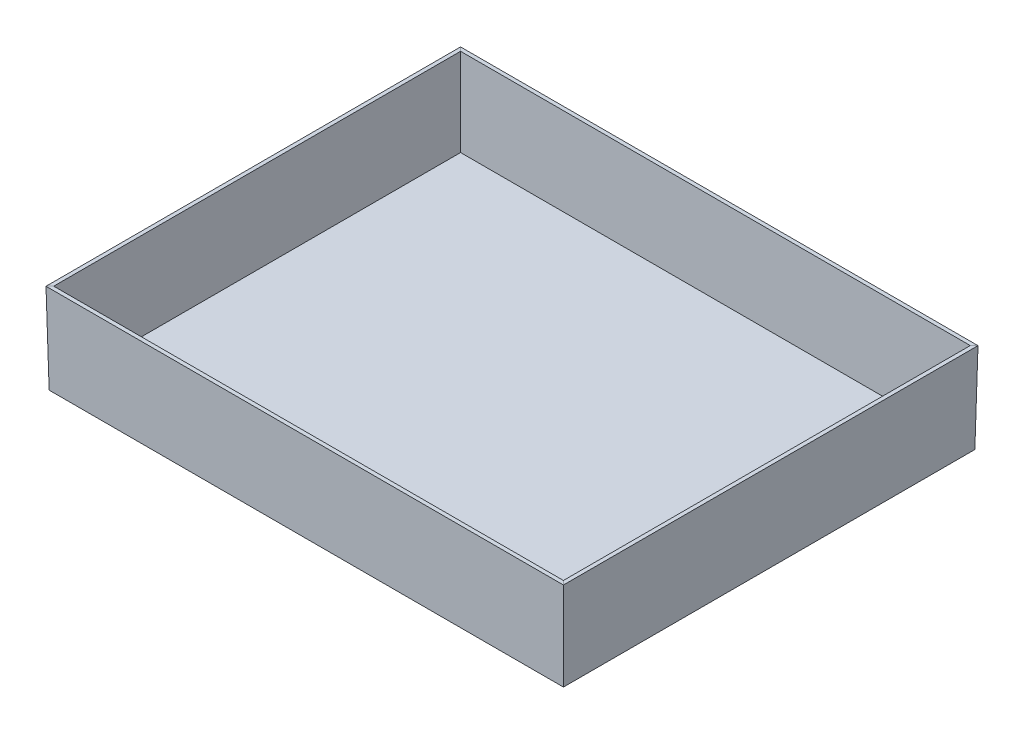
ISO-10303-21;
HEADER;
FILE_DESCRIPTION(('STEP AP214'),'2;1');
FILE_NAME('part.step','',(''),(''),'','','');
FILE_SCHEMA(('AUTOMOTIVE_DESIGN { 1 0 10303 214 1 1 1 1 }'));
ENDSEC;
DATA;
#1=APPLICATION_CONTEXT('core data for automotive mechanical design processes');
#2=APPLICATION_PROTOCOL_DEFINITION('international standard','automotive_design',2000,#1);
#3=PRODUCT_CONTEXT('',#1,'mechanical');
#4=PRODUCT('Part','Part','',(#3));
#5=PRODUCT_RELATED_PRODUCT_CATEGORY('part','',(#4));
#6=PRODUCT_DEFINITION_FORMATION('','',#4);
#7=PRODUCT_DEFINITION_CONTEXT('part definition',#1,'design');
#8=PRODUCT_DEFINITION('design','',#6,#7);
#9=PRODUCT_DEFINITION_SHAPE('','',#8);
#10=(LENGTH_UNIT() NAMED_UNIT(*) SI_UNIT(.MILLI.,.METRE.));
#11=(NAMED_UNIT(*) PLANE_ANGLE_UNIT() SI_UNIT($,.RADIAN.));
#12=(NAMED_UNIT(*) SI_UNIT($,.STERADIAN.) SOLID_ANGLE_UNIT());
#13=UNCERTAINTY_MEASURE_WITH_UNIT(LENGTH_MEASURE(1.E-05),#10,'distance_accuracy_value','');
#14=(GEOMETRIC_REPRESENTATION_CONTEXT(3) GLOBAL_UNCERTAINTY_ASSIGNED_CONTEXT((#13)) GLOBAL_UNIT_ASSIGNED_CONTEXT((#10,
#11,#12)) REPRESENTATION_CONTEXT('',''));
#15=CARTESIAN_POINT('',(0.,0.,0.));
#16=DIRECTION('',(0.,0.,1.));
#17=DIRECTION('',(1.,0.,0.));
#18=AXIS2_PLACEMENT_3D('',#15,#16,#17);
#19=CARTESIAN_POINT('',(-100.610927272488,35.,80.));
#20=DIRECTION('',(0.0174524064372835,-0.999847695156391,0.));
#21=DIRECTION('',(0.,0.,1.));
#22=AXIS2_PLACEMENT_3D('',#19,#20,#21);
#23=PLANE('',#22);
#24=DIRECTION('',(-0.707052927141246,-0.0123416547509364,0.707052927141246));
#25=VECTOR('',#24,1.);
#26=CARTESIAN_POINT('',(-99.111155729753,35.0261786096559,79.111155729753));
#27=LINE('',#26,#25);
#28=CARTESIAN_POINT('',(-99.111155729753,35.0261786096559,79.111155729753));
#29=VERTEX_POINT('',#28);
#30=CARTESIAN_POINT('',(-100.610927272488,35.,80.6109272724876));
#31=VERTEX_POINT('',#30);
#32=EDGE_CURVE('E65',#29,#31,#27,.T.);
#33=ORIENTED_EDGE('',*,*,#32,.F.);
#34=DIRECTION('',(0.,0.,1.));
#35=VECTOR('',#34,1.);
#36=CARTESIAN_POINT('',(-99.111155729753,35.0261786096559,80.));
#37=LINE('',#36,#35);
#38=CARTESIAN_POINT('',(-99.111155729753,35.0261786096559,-79.111155729753));
#39=VERTEX_POINT('',#38);
#40=EDGE_CURVE('E123',#39,#29,#37,.T.);
#41=ORIENTED_EDGE('',*,*,#40,.F.);
#42=DIRECTION('',(-0.707052927141246,-0.0123416547509364,-0.707052927141246));
#43=VECTOR('',#42,1.);
#44=CARTESIAN_POINT('',(-99.111155729753,35.0261786096559,-79.111155729753));
#45=LINE('',#44,#43);
#46=CARTESIAN_POINT('',(-100.610927272488,35.,-80.6109272724876));
#47=VERTEX_POINT('',#46);
#48=EDGE_CURVE('E163',#39,#47,#45,.T.);
#49=ORIENTED_EDGE('',*,*,#48,.T.);
#50=DIRECTION('',(0.,0.,1.));
#51=VECTOR('',#50,1.);
#52=CARTESIAN_POINT('',(-100.610927272488,35.,80.));
#53=LINE('',#52,#51);
#54=EDGE_CURVE('E183',#47,#31,#53,.T.);
#55=ORIENTED_EDGE('',*,*,#54,.T.);
#56=EDGE_LOOP('',(#33,#41,#49,#55));
#57=FACE_BOUND('',#56,.T.);
#58=ADVANCED_FACE('F55',(#57),#23,.F.);
#59=CARTESIAN_POINT('',(-100.,35.,-80.6109272724876));
#60=DIRECTION('',(0.,-0.999847695156391,0.0174524064372835));
#61=DIRECTION('',(-1.,0.,0.));
#62=AXIS2_PLACEMENT_3D('',#59,#60,#61);
#63=PLANE('',#62);
#64=ORIENTED_EDGE('',*,*,#48,.F.);
#65=DIRECTION('',(1.,0.,0.));
#66=VECTOR('',#65,1.);
#67=CARTESIAN_POINT('',(-100.,35.0261786096559,-79.111155729753));
#68=LINE('',#67,#66);
#69=CARTESIAN_POINT('',(99.111155729753,35.0261786096559,-79.111155729753));
#70=VERTEX_POINT('',#69);
#71=EDGE_CURVE('E152',#70,#39,#68,.F.);
#72=ORIENTED_EDGE('',*,*,#71,.F.);
#73=DIRECTION('',(0.707052927141236,-0.0123416547509363,-0.707052927141256));
#74=VECTOR('',#73,1.);
#75=CARTESIAN_POINT('',(99.111155729753,35.0261786096559,-79.111155729753));
#76=LINE('',#75,#74);
#77=CARTESIAN_POINT('',(100.610927272488,35.,-80.6109272724876));
#78=VERTEX_POINT('',#77);
#79=EDGE_CURVE('E138',#70,#78,#76,.T.);
#80=ORIENTED_EDGE('',*,*,#79,.T.);
#81=DIRECTION('',(-1.,0.,0.));
#82=VECTOR('',#81,1.);
#83=CARTESIAN_POINT('',(-100.,35.,-80.6109272724876));
#84=LINE('',#83,#82);
#85=EDGE_CURVE('E179',#78,#47,#84,.T.);
#86=ORIENTED_EDGE('',*,*,#85,.T.);
#87=EDGE_LOOP('',(#64,#72,#80,#86));
#88=FACE_BOUND('',#87,.T.);
#89=ADVANCED_FACE('F195',(#88),#63,.F.);
#90=CARTESIAN_POINT('',(100.610927272488,35.,80.));
#91=DIRECTION('',(-0.0174524064372835,-0.999847695156391,0.));
#92=DIRECTION('',(0.,0.,-1.));
#93=AXIS2_PLACEMENT_3D('',#90,#91,#92);
#94=PLANE('',#93);
#95=ORIENTED_EDGE('',*,*,#79,.F.);
#96=DIRECTION('',(0.,0.,1.));
#97=VECTOR('',#96,1.);
#98=CARTESIAN_POINT('',(99.111155729753,35.0261786096559,80.));
#99=LINE('',#98,#97);
#100=CARTESIAN_POINT('',(99.111155729753,35.0261786096559,79.111155729753));
#101=VERTEX_POINT('',#100);
#102=EDGE_CURVE('E117',#101,#70,#99,.F.);
#103=ORIENTED_EDGE('',*,*,#102,.F.);
#104=DIRECTION('',(0.707052927141246,-0.0123416547509364,0.707052927141246));
#105=VECTOR('',#104,1.);
#106=CARTESIAN_POINT('',(99.111155729753,35.0261786096559,79.111155729753));
#107=LINE('',#106,#105);
#108=CARTESIAN_POINT('',(100.610927272488,35.,80.6109272724876));
#109=VERTEX_POINT('',#108);
#110=EDGE_CURVE('E130',#101,#109,#107,.T.);
#111=ORIENTED_EDGE('',*,*,#110,.T.);
#112=DIRECTION('',(0.,0.,-1.));
#113=VECTOR('',#112,1.);
#114=CARTESIAN_POINT('',(100.610927272488,35.,80.));
#115=LINE('',#114,#113);
#116=EDGE_CURVE('E176',#109,#78,#115,.T.);
#117=ORIENTED_EDGE('',*,*,#116,.T.);
#118=EDGE_LOOP('',(#95,#103,#111,#117));
#119=FACE_BOUND('',#118,.T.);
#120=ADVANCED_FACE('F145',(#119),#94,.F.);
#121=CARTESIAN_POINT('',(-100.,35.,80.6109272724876));
#122=DIRECTION('',(0.,-0.999847695156391,-0.0174524064372835));
#123=DIRECTION('',(1.,0.,0.));
#124=AXIS2_PLACEMENT_3D('',#121,#122,#123);
#125=PLANE('',#124);
#126=DIRECTION('',(1.,0.,0.));
#127=VECTOR('',#126,1.);
#128=CARTESIAN_POINT('',(-100.,35.0261786096559,79.111155729753));
#129=LINE('',#128,#127);
#130=EDGE_CURVE('E132',#29,#101,#129,.T.);
#131=ORIENTED_EDGE('',*,*,#130,.F.);
#132=ORIENTED_EDGE('',*,*,#32,.T.);
#133=DIRECTION('',(1.,0.,0.));
#134=VECTOR('',#133,1.);
#135=CARTESIAN_POINT('',(-100.,35.,80.6109272724876));
#136=LINE('',#135,#134);
#137=EDGE_CURVE('E134',#31,#109,#136,.T.);
#138=ORIENTED_EDGE('',*,*,#137,.T.);
#139=ORIENTED_EDGE('',*,*,#110,.F.);
#140=EDGE_LOOP('',(#131,#132,#138,#139));
#141=FACE_BOUND('',#140,.T.);
#142=ADVANCED_FACE('F57',(#141),#125,.F.);
#143=CARTESIAN_POINT('',(100.,0.,80.));
#144=DIRECTION('',(0.999847695156391,-0.0174524064372835,0.));
#145=DIRECTION('',(0.0174524064372835,0.999847695156391,0.));
#146=AXIS2_PLACEMENT_3D('',#143,#144,#145);
#147=PLANE('',#146);
#148=ORIENTED_EDGE('',*,*,#116,.F.);
#149=DIRECTION('',(0.0174497491606827,0.999695459881887,0.0174497491606827));
#150=VECTOR('',#149,1.);
#151=CARTESIAN_POINT('',(99.9391012508459,-3.48888700240246,79.9391012508459));
#152=LINE('',#151,#150);
#153=CARTESIAN_POINT('',(100.,0.,80.));
#154=VERTEX_POINT('',#153);
#155=EDGE_CURVE('E170',#154,#109,#152,.T.);
#156=ORIENTED_EDGE('',*,*,#155,.F.);
#157=DIRECTION('',(0.,0.,-1.));
#158=VECTOR('',#157,1.);
#159=CARTESIAN_POINT('',(100.,0.,80.));
#160=LINE('',#159,#158);
#161=CARTESIAN_POINT('',(100.,0.,-80.));
#162=VERTEX_POINT('',#161);
#163=EDGE_CURVE('E81',#154,#162,#160,.T.);
#164=ORIENTED_EDGE('',*,*,#163,.T.);
#165=DIRECTION('',(0.0174497491606827,0.999695459881887,-0.0174497491606827));
#166=VECTOR('',#165,1.);
#167=CARTESIAN_POINT('',(99.9512810006767,-2.79110960192197,-79.9512810006767));
#168=LINE('',#167,#166);
#169=EDGE_CURVE('E59',#162,#78,#168,.T.);
#170=ORIENTED_EDGE('',*,*,#169,.T.);
#171=EDGE_LOOP('',(#148,#156,#164,#170));
#172=FACE_BOUND('',#171,.T.);
#173=ADVANCED_FACE('F262',(#172),#147,.T.);
#174=CARTESIAN_POINT('',(-100.,0.,-80.));
#175=DIRECTION('',(0.,-0.0174524064372835,-0.999847695156391));
#176=DIRECTION('',(0.,0.999847695156391,-0.0174524064372835));
#177=AXIS2_PLACEMENT_3D('',#174,#175,#176);
#178=PLANE('',#177);
#179=ORIENTED_EDGE('',*,*,#85,.F.);
#180=ORIENTED_EDGE('',*,*,#169,.F.);
#181=DIRECTION('',(-1.,0.,0.));
#182=VECTOR('',#181,1.);
#183=CARTESIAN_POINT('',(-100.,0.,-80.));
#184=LINE('',#183,#182);
#185=CARTESIAN_POINT('',(-100.,0.,-80.));
#186=VERTEX_POINT('',#185);
#187=EDGE_CURVE('E178',#162,#186,#184,.T.);
#188=ORIENTED_EDGE('',*,*,#187,.T.);
#189=DIRECTION('',(-0.0174497491606827,0.999695459881887,-0.0174497491606827));
#190=VECTOR('',#189,1.);
#191=CARTESIAN_POINT('',(-100.,0.,-80.));
#192=LINE('',#191,#190);
#193=EDGE_CURVE('E185',#186,#47,#192,.T.);
#194=ORIENTED_EDGE('',*,*,#193,.T.);
#195=EDGE_LOOP('',(#179,#180,#188,#194));
#196=FACE_BOUND('',#195,.T.);
#197=ADVANCED_FACE('F220',(#196),#178,.T.);
#198=CARTESIAN_POINT('',(-100.,0.,80.));
#199=DIRECTION('',(-0.999847695156391,-0.0174524064372835,0.));
#200=DIRECTION('',(0.0174524064372835,-0.999847695156391,0.));
#201=AXIS2_PLACEMENT_3D('',#198,#199,#200);
#202=PLANE('',#201);
#203=ORIENTED_EDGE('',*,*,#54,.F.);
#204=ORIENTED_EDGE('',*,*,#193,.F.);
#205=DIRECTION('',(0.,0.,1.));
#206=VECTOR('',#205,1.);
#207=CARTESIAN_POINT('',(-100.,0.,80.));
#208=LINE('',#207,#206);
#209=CARTESIAN_POINT('',(-100.,0.,80.));
#210=VERTEX_POINT('',#209);
#211=EDGE_CURVE('E182',#186,#210,#208,.T.);
#212=ORIENTED_EDGE('',*,*,#211,.T.);
#213=DIRECTION('',(-0.0174497491606827,0.999695459881887,0.0174497491606827));
#214=VECTOR('',#213,1.);
#215=CARTESIAN_POINT('',(-100.,0.,80.));
#216=LINE('',#215,#214);
#217=EDGE_CURVE('E150',#210,#31,#216,.T.);
#218=ORIENTED_EDGE('',*,*,#217,.T.);
#219=EDGE_LOOP('',(#203,#204,#212,#218));
#220=FACE_BOUND('',#219,.T.);
#221=ADVANCED_FACE('F223',(#220),#202,.T.);
#222=CARTESIAN_POINT('',(-100.,0.,80.));
#223=DIRECTION('',(0.,-0.0174524064372835,0.999847695156391));
#224=DIRECTION('',(0.,-0.999847695156391,-0.0174524064372835));
#225=AXIS2_PLACEMENT_3D('',#222,#223,#224);
#226=PLANE('',#225);
#227=ORIENTED_EDGE('',*,*,#137,.F.);
#228=ORIENTED_EDGE('',*,*,#217,.F.);
#229=DIRECTION('',(1.,0.,0.));
#230=VECTOR('',#229,1.);
#231=CARTESIAN_POINT('',(-100.,0.,80.));
#232=LINE('',#231,#230);
#233=EDGE_CURVE('E169',#210,#154,#232,.T.);
#234=ORIENTED_EDGE('',*,*,#233,.T.);
#235=ORIENTED_EDGE('',*,*,#155,.T.);
#236=EDGE_LOOP('',(#227,#228,#234,#235));
#237=FACE_BOUND('',#236,.T.);
#238=ADVANCED_FACE('F202',(#237),#226,.T.);
#239=CARTESIAN_POINT('',(98.5002284572654,0.0261786096559253,80.));
#240=DIRECTION('',(0.999847695156391,-0.0174524064372835,0.));
#241=DIRECTION('',(0.0174524064372835,0.999847695156391,0.));
#242=AXIS2_PLACEMENT_3D('',#239,#240,#241);
#243=PLANE('',#242);
#244=DIRECTION('',(0.0174497491606827,0.999695459881887,-0.0174497491606827));
#245=VECTOR('',#244,1.);
#246=CARTESIAN_POINT('',(98.4519661289969,-2.73876832505594,-78.4519661289969));
#247=LINE('',#246,#245);
#248=CARTESIAN_POINT('',(98.5259541053265,1.5,-78.5259541053264));
#249=VERTEX_POINT('',#248);
#250=EDGE_CURVE('E148',#249,#70,#247,.T.);
#251=ORIENTED_EDGE('',*,*,#250,.F.);
#252=DIRECTION('',(0.,0.,1.));
#253=VECTOR('',#252,1.);
#254=CARTESIAN_POINT('',(98.5259541053265,1.5,80.));
#255=LINE('',#254,#253);
#256=CARTESIAN_POINT('',(98.5259541053265,1.5,78.5259541053265));
#257=VERTEX_POINT('',#256);
#258=EDGE_CURVE('E120',#249,#257,#255,.T.);
#259=ORIENTED_EDGE('',*,*,#258,.T.);
#260=DIRECTION('',(0.0174497491606827,0.999695459881887,0.0174497491606827));
#261=VECTOR('',#260,1.);
#262=CARTESIAN_POINT('',(98.4397863791661,-3.43654572553643,78.4397863791661));
#263=LINE('',#262,#261);
#264=EDGE_CURVE('E112',#257,#101,#263,.T.);
#265=ORIENTED_EDGE('',*,*,#264,.T.);
#266=ORIENTED_EDGE('',*,*,#102,.T.);
#267=EDGE_LOOP('',(#251,#259,#265,#266));
#268=FACE_BOUND('',#267,.T.);
#269=ADVANCED_FACE('F115',(#268),#243,.F.);
#270=CARTESIAN_POINT('',(-100.,0.0261786096559253,-78.5002284572654));
#271=DIRECTION('',(0.,-0.0174524064372835,-0.999847695156391));
#272=DIRECTION('',(0.,0.999847695156391,-0.0174524064372835));
#273=AXIS2_PLACEMENT_3D('',#270,#271,#272);
#274=PLANE('',#273);
#275=DIRECTION('',(-0.0174497491606827,0.999695459881887,-0.0174497491606827));
#276=VECTOR('',#275,1.);
#277=CARTESIAN_POINT('',(-98.5006851283203,0.0523412768660243,-78.5006851283203));
#278=LINE('',#277,#276);
#279=CARTESIAN_POINT('',(-98.5259541053265,1.5,-78.5259541053265));
#280=VERTEX_POINT('',#279);
#281=EDGE_CURVE('E159',#280,#39,#278,.T.);
#282=ORIENTED_EDGE('',*,*,#281,.F.);
#283=DIRECTION('',(1.,0.,0.));
#284=VECTOR('',#283,1.);
#285=CARTESIAN_POINT('',(-100.,1.5,-78.5259541053265));
#286=LINE('',#285,#284);
#287=EDGE_CURVE('E229',#280,#249,#286,.T.);
#288=ORIENTED_EDGE('',*,*,#287,.T.);
#289=ORIENTED_EDGE('',*,*,#250,.T.);
#290=ORIENTED_EDGE('',*,*,#71,.T.);
#291=EDGE_LOOP('',(#282,#288,#289,#290));
#292=FACE_BOUND('',#291,.T.);
#293=ADVANCED_FACE('F199',(#292),#274,.F.);
#294=CARTESIAN_POINT('',(-98.5002284572654,0.0261786096559253,80.));
#295=DIRECTION('',(-0.999847695156391,-0.0174524064372835,0.));
#296=DIRECTION('',(0.0174524064372835,-0.999847695156391,0.));
#297=AXIS2_PLACEMENT_3D('',#294,#295,#296);
#298=PLANE('',#297);
#299=DIRECTION('',(-0.0174497491606827,0.999695459881887,0.0174497491606827));
#300=VECTOR('',#299,1.);
#301=CARTESIAN_POINT('',(-98.5006851283203,0.0523412768660243,78.5006851283203));
#302=LINE('',#301,#300);
#303=CARTESIAN_POINT('',(-98.5259541053265,1.5,78.5259541053265));
#304=VERTEX_POINT('',#303);
#305=EDGE_CURVE('E124',#304,#29,#302,.T.);
#306=ORIENTED_EDGE('',*,*,#305,.F.);
#307=DIRECTION('',(0.,0.,-1.));
#308=VECTOR('',#307,1.);
#309=CARTESIAN_POINT('',(-98.5259541053265,1.5,80.));
#310=LINE('',#309,#308);
#311=EDGE_CURVE('E73',#304,#280,#310,.T.);
#312=ORIENTED_EDGE('',*,*,#311,.T.);
#313=ORIENTED_EDGE('',*,*,#281,.T.);
#314=ORIENTED_EDGE('',*,*,#40,.T.);
#315=EDGE_LOOP('',(#306,#312,#313,#314));
#316=FACE_BOUND('',#315,.T.);
#317=ADVANCED_FACE('F189',(#316),#298,.F.);
#318=CARTESIAN_POINT('',(-100.,0.0261786096559253,78.5002284572654));
#319=DIRECTION('',(0.,-0.0174524064372835,0.999847695156391));
#320=DIRECTION('',(0.,-0.999847695156391,-0.0174524064372835));
#321=AXIS2_PLACEMENT_3D('',#318,#319,#320);
#322=PLANE('',#321);
#323=ORIENTED_EDGE('',*,*,#264,.F.);
#324=DIRECTION('',(-1.,0.,0.));
#325=VECTOR('',#324,1.);
#326=CARTESIAN_POINT('',(-100.,1.5,78.5259541053265));
#327=LINE('',#326,#325);
#328=EDGE_CURVE('E13',#257,#304,#327,.T.);
#329=ORIENTED_EDGE('',*,*,#328,.T.);
#330=ORIENTED_EDGE('',*,*,#305,.T.);
#331=ORIENTED_EDGE('',*,*,#130,.T.);
#332=EDGE_LOOP('',(#323,#329,#330,#331));
#333=FACE_BOUND('',#332,.T.);
#334=ADVANCED_FACE('F140',(#333),#322,.F.);
#335=CARTESIAN_POINT('',(100.,0.,-80.));
#336=CARTESIAN_POINT('',(100.,0.,-26.6666666666667));
#337=CARTESIAN_POINT('',(100.,0.,26.6666666666667));
#338=CARTESIAN_POINT('',(100.,0.,80.));
#339=CARTESIAN_POINT('',(33.3333333333333,0.,-80.));
#340=CARTESIAN_POINT('',(33.3333333333333,0.,-26.6666666666667));
#341=CARTESIAN_POINT('',(33.3333333333333,0.,26.6666666666667));
#342=CARTESIAN_POINT('',(33.3333333333333,0.,80.));
#343=CARTESIAN_POINT('',(-33.3333333333333,0.,-80.));
#344=CARTESIAN_POINT('',(-33.3333333333333,0.,-26.6666666666667));
#345=CARTESIAN_POINT('',(-33.3333333333333,0.,26.6666666666667));
#346=CARTESIAN_POINT('',(-33.3333333333333,0.,80.));
#347=CARTESIAN_POINT('',(-100.,0.,-80.));
#348=CARTESIAN_POINT('',(-100.,0.,-26.6666666666667));
#349=CARTESIAN_POINT('',(-100.,0.,26.6666666666667));
#350=CARTESIAN_POINT('',(-100.,0.,80.));
#351=B_SPLINE_SURFACE_WITH_KNOTS('',3,3,((#335,#336,#337,#338),(#339,#340,#341,#342),(#343,#344,
#345,#346),(#347,#348,#349,#350)),.UNSPECIFIED.,.F.,.F.,.F.,(4,4),(4,4),(0.,1.),(0.,1.),.UNSPECIFIED.);
#352=OFFSET_SURFACE('',#351,1.5,.F.);
#353=ORIENTED_EDGE('',*,*,#258,.F.);
#354=ORIENTED_EDGE('',*,*,#287,.F.);
#355=ORIENTED_EDGE('',*,*,#311,.F.);
#356=ORIENTED_EDGE('',*,*,#328,.F.);
#357=EDGE_LOOP('',(#353,#354,#355,#356));
#358=FACE_BOUND('',#357,.T.);
#359=ADVANCED_FACE('F230',(#358),#352,.T.);
#360=CARTESIAN_POINT('',(100.,0.,-80.));
#361=DIRECTION('',(0.,1.,0.));
#362=DIRECTION('',(-1.,0.,0.));
#363=AXIS2_PLACEMENT_3D('',#360,#361,#362);
#364=PLANE('',#363);
#365=ORIENTED_EDGE('',*,*,#187,.F.);
#366=ORIENTED_EDGE('',*,*,#163,.F.);
#367=ORIENTED_EDGE('',*,*,#233,.F.);
#368=ORIENTED_EDGE('',*,*,#211,.F.);
#369=EDGE_LOOP('',(#365,#366,#367,#368));
#370=FACE_BOUND('',#369,.T.);
#371=ADVANCED_FACE('F233',(#370),#364,.F.);
#372=CLOSED_SHELL('',(#58,#89,#120,#142,#173,#197,#221,#238,#269,#293,#317,#334,#359,#371));
#373=MANIFOLD_SOLID_BREP('B2',#372);
#374=ADVANCED_BREP_SHAPE_REPRESENTATION('',(#18,#373),#14);
#375=SHAPE_DEFINITION_REPRESENTATION(#9,#374);
ENDSEC;
END-ISO-10303-21;
